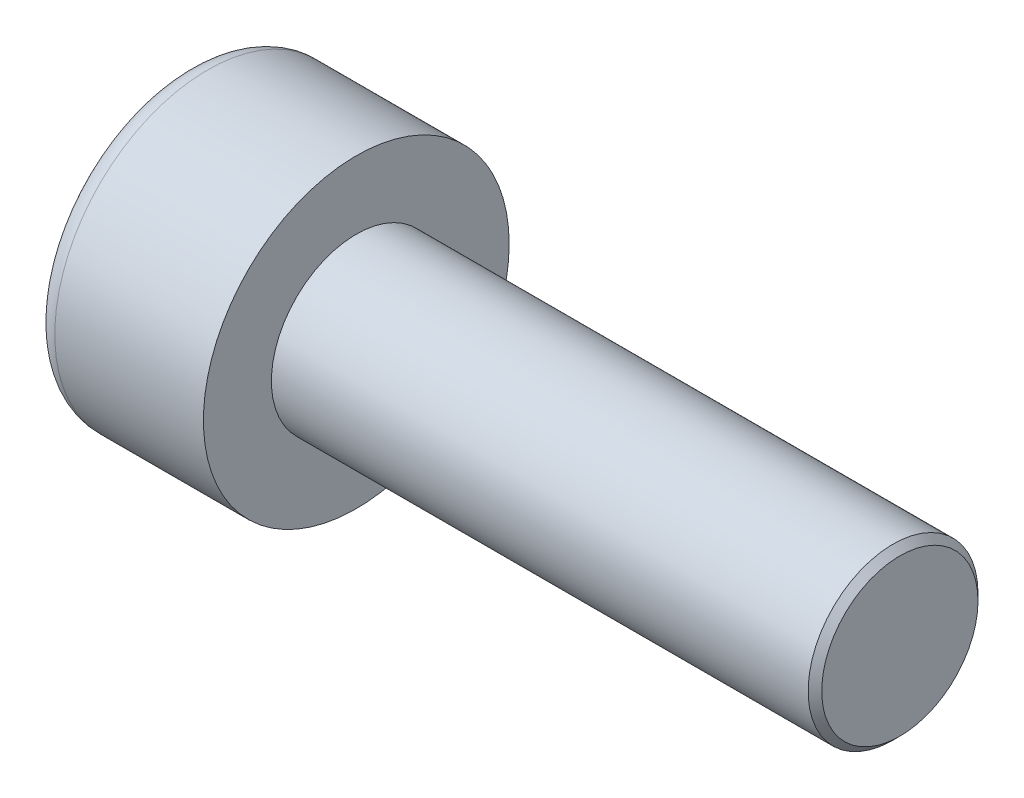
ISO-10303-21;
HEADER;
FILE_DESCRIPTION(('STEP AP214'),'2;1');
FILE_NAME('part.step','',(''),(''),'','','');
FILE_SCHEMA(('AUTOMOTIVE_DESIGN { 1 0 10303 214 1 1 1 1 }'));
ENDSEC;
DATA;
#1=APPLICATION_CONTEXT('core data for automotive mechanical design processes');
#2=APPLICATION_PROTOCOL_DEFINITION('international standard','automotive_design',2000,#1);
#3=PRODUCT_CONTEXT('',#1,'mechanical');
#4=PRODUCT('Part','Part','',(#3));
#5=PRODUCT_RELATED_PRODUCT_CATEGORY('part','',(#4));
#6=PRODUCT_DEFINITION_FORMATION('','',#4);
#7=PRODUCT_DEFINITION_CONTEXT('part definition',#1,'design');
#8=PRODUCT_DEFINITION('design','',#6,#7);
#9=PRODUCT_DEFINITION_SHAPE('','',#8);
#10=(LENGTH_UNIT() NAMED_UNIT(*) SI_UNIT(.MILLI.,.METRE.));
#11=(NAMED_UNIT(*) PLANE_ANGLE_UNIT() SI_UNIT($,.RADIAN.));
#12=(NAMED_UNIT(*) SI_UNIT($,.STERADIAN.) SOLID_ANGLE_UNIT());
#13=UNCERTAINTY_MEASURE_WITH_UNIT(LENGTH_MEASURE(1.E-05),#10,'distance_accuracy_value','');
#14=(GEOMETRIC_REPRESENTATION_CONTEXT(3) GLOBAL_UNCERTAINTY_ASSIGNED_CONTEXT((#13)) GLOBAL_UNIT_ASSIGNED_CONTEXT((#10,
#11,#12)) REPRESENTATION_CONTEXT('',''));
#15=CARTESIAN_POINT('',(0.,0.,0.));
#16=DIRECTION('',(0.,0.,1.));
#17=DIRECTION('',(1.,0.,0.));
#18=AXIS2_PLACEMENT_3D('',#15,#16,#17);
#19=CARTESIAN_POINT('',(1.1,1.,-1.73205080756888));
#20=DIRECTION('',(1.,0.,0.));
#21=DIRECTION('',(0.,0.,-1.));
#22=AXIS2_PLACEMENT_3D('',#19,#20,#21);
#23=PLANE('',#22);
#24=CARTESIAN_POINT('',(1.1,0.,0.));
#25=DIRECTION('',(1.,0.,0.));
#26=DIRECTION('',(0.,0.,-1.));
#27=AXIS2_PLACEMENT_3D('',#24,#25,#26);
#28=CIRCLE('',#27,1.);
#29=CARTESIAN_POINT('',(1.1,-0.5,-0.866025403784439));
#30=VERTEX_POINT('',#29);
#31=CARTESIAN_POINT('',(1.1,-1.,0.));
#32=VERTEX_POINT('',#31);
#33=EDGE_CURVE('E162',#30,#32,#28,.F.);
#34=ORIENTED_EDGE('',*,*,#33,.F.);
#35=DIRECTION('',(0.,0.866025403784439,-0.5));
#36=VECTOR('',#35,1.);
#37=CARTESIAN_POINT('',(1.1,-1.,-0.577350269189627));
#38=LINE('',#37,#36);
#39=CARTESIAN_POINT('',(1.1,-1.,-0.577350269189627));
#40=VERTEX_POINT('',#39);
#41=EDGE_CURVE('E170',#40,#30,#38,.T.);
#42=ORIENTED_EDGE('',*,*,#41,.F.);
#43=DIRECTION('',(0.,0.,-1.));
#44=VECTOR('',#43,1.);
#45=CARTESIAN_POINT('',(1.1,-1.,0.577350269189626));
#46=LINE('',#45,#44);
#47=EDGE_CURVE('E187',#32,#40,#46,.T.);
#48=ORIENTED_EDGE('',*,*,#47,.F.);
#49=EDGE_LOOP('',(#34,#42,#48));
#50=FACE_BOUND('',#49,.T.);
#51=ADVANCED_FACE('F39',(#50),#23,.F.);
#52=CARTESIAN_POINT('',(1.1,-0.5,0.866025403784438));
#53=VERTEX_POINT('',#52);
#54=EDGE_CURVE('E292',#32,#53,#28,.F.);
#55=ORIENTED_EDGE('',*,*,#54,.F.);
#56=CARTESIAN_POINT('',(1.1,-1.,0.577350269189626));
#57=VERTEX_POINT('',#56);
#58=EDGE_CURVE('E188',#57,#32,#46,.T.);
#59=ORIENTED_EDGE('',*,*,#58,.F.);
#60=DIRECTION('',(0.,-0.866025403784439,-0.5));
#61=VECTOR('',#60,1.);
#62=CARTESIAN_POINT('',(1.1,0.,1.15470053837925));
#63=LINE('',#62,#61);
#64=EDGE_CURVE('E183',#53,#57,#63,.T.);
#65=ORIENTED_EDGE('',*,*,#64,.F.);
#66=EDGE_LOOP('',(#55,#59,#65));
#67=FACE_BOUND('',#66,.T.);
#68=ADVANCED_FACE('F128',(#67),#23,.F.);
#69=CARTESIAN_POINT('',(1.1,0.5,0.866025403784438));
#70=VERTEX_POINT('',#69);
#71=EDGE_CURVE('E288',#53,#70,#28,.F.);
#72=ORIENTED_EDGE('',*,*,#71,.F.);
#73=CARTESIAN_POINT('',(1.1,0.,1.15470053837925));
#74=VERTEX_POINT('',#73);
#75=EDGE_CURVE('E184',#74,#53,#63,.T.);
#76=ORIENTED_EDGE('',*,*,#75,.F.);
#77=DIRECTION('',(0.,-0.866025403784439,0.5));
#78=VECTOR('',#77,1.);
#79=CARTESIAN_POINT('',(1.1,1.,0.577350269189626));
#80=LINE('',#79,#78);
#81=EDGE_CURVE('E179',#70,#74,#80,.T.);
#82=ORIENTED_EDGE('',*,*,#81,.F.);
#83=EDGE_LOOP('',(#72,#76,#82));
#84=FACE_BOUND('',#83,.T.);
#85=ADVANCED_FACE('F134',(#84),#23,.F.);
#86=CARTESIAN_POINT('',(1.1,1.,0.));
#87=VERTEX_POINT('',#86);
#88=EDGE_CURVE('E159',#70,#87,#28,.F.);
#89=ORIENTED_EDGE('',*,*,#88,.F.);
#90=CARTESIAN_POINT('',(1.1,1.,0.577350269189626));
#91=VERTEX_POINT('',#90);
#92=EDGE_CURVE('E180',#91,#70,#80,.T.);
#93=ORIENTED_EDGE('',*,*,#92,.F.);
#94=DIRECTION('',(0.,0.,1.));
#95=VECTOR('',#94,1.);
#96=CARTESIAN_POINT('',(1.1,1.,-0.577350269189625));
#97=LINE('',#96,#95);
#98=EDGE_CURVE('E174',#87,#91,#97,.T.);
#99=ORIENTED_EDGE('',*,*,#98,.F.);
#100=EDGE_LOOP('',(#89,#93,#99));
#101=FACE_BOUND('',#100,.T.);
#102=ADVANCED_FACE('F148',(#101),#23,.F.);
#103=CARTESIAN_POINT('',(1.1,0.,0.));
#104=DIRECTION('',(1.,0.,0.));
#105=DIRECTION('',(0.,0.,-1.));
#106=AXIS2_PLACEMENT_3D('',#103,#104,#105);
#107=CIRCLE('',#106,1.);
#108=CARTESIAN_POINT('',(1.1,0.5,-0.866025403784438));
#109=VERTEX_POINT('',#108);
#110=EDGE_CURVE('E54',#109,#87,#107,.T.);
#111=ORIENTED_EDGE('',*,*,#110,.T.);
#112=CARTESIAN_POINT('',(1.1,1.,-0.577350269189625));
#113=VERTEX_POINT('',#112);
#114=EDGE_CURVE('E167',#113,#87,#97,.T.);
#115=ORIENTED_EDGE('',*,*,#114,.F.);
#116=DIRECTION('',(0.,0.866025403784439,0.5));
#117=VECTOR('',#116,1.);
#118=CARTESIAN_POINT('',(1.1,0.,-1.15470053837925));
#119=LINE('',#118,#117);
#120=EDGE_CURVE('E164',#109,#113,#119,.T.);
#121=ORIENTED_EDGE('',*,*,#120,.F.);
#122=EDGE_LOOP('',(#111,#115,#121));
#123=FACE_BOUND('',#122,.T.);
#124=ADVANCED_FACE('F139',(#123),#23,.F.);
#125=EDGE_CURVE('E152',#109,#30,#28,.F.);
#126=ORIENTED_EDGE('',*,*,#125,.F.);
#127=CARTESIAN_POINT('',(1.1,0.,-1.15470053837925));
#128=VERTEX_POINT('',#127);
#129=EDGE_CURVE('E155',#128,#109,#119,.T.);
#130=ORIENTED_EDGE('',*,*,#129,.F.);
#131=EDGE_CURVE('E157',#30,#128,#38,.T.);
#132=ORIENTED_EDGE('',*,*,#131,.F.);
#133=EDGE_LOOP('',(#126,#130,#132));
#134=FACE_BOUND('',#133,.T.);
#135=ADVANCED_FACE('F130',(#134),#23,.F.);
#136=CARTESIAN_POINT('',(0.,0.,0.));
#137=DIRECTION('',(1.,0.,0.));
#138=DIRECTION('',(0.,0.,-1.));
#139=AXIS2_PLACEMENT_3D('',#136,#137,#138);
#140=PLANE('',#139);
#141=CARTESIAN_POINT('',(0.,0.,0.));
#142=DIRECTION('',(1.,0.,0.));
#143=DIRECTION('',(0.,0.,-1.));
#144=AXIS2_PLACEMENT_3D('',#141,#142,#143);
#145=CIRCLE('',#144,1.9375);
#146=CARTESIAN_POINT('',(0.,0.,-1.9375));
#147=VERTEX_POINT('',#146);
#148=EDGE_CURVE('E227',#147,#147,#145,.F.);
#149=ORIENTED_EDGE('',*,*,#148,.T.);
#150=EDGE_LOOP('',(#149));
#151=FACE_BOUND('',#150,.T.);
#152=DIRECTION('',(0.,0.866025403784439,-0.5));
#153=VECTOR('',#152,1.);
#154=CARTESIAN_POINT('',(0.,-1.,-0.577350269189627));
#155=LINE('',#154,#153);
#156=CARTESIAN_POINT('',(0.,-1.,-0.577350269189627));
#157=VERTEX_POINT('',#156);
#158=CARTESIAN_POINT('',(0.,0.,-1.15470053837925));
#159=VERTEX_POINT('',#158);
#160=EDGE_CURVE('E62',#157,#159,#155,.T.);
#161=ORIENTED_EDGE('',*,*,#160,.T.);
#162=DIRECTION('',(0.,0.866025403784439,0.5));
#163=VECTOR('',#162,1.);
#164=CARTESIAN_POINT('',(0.,0.,-1.15470053837925));
#165=LINE('',#164,#163);
#166=CARTESIAN_POINT('',(0.,1.,-0.577350269189625));
#167=VERTEX_POINT('',#166);
#168=EDGE_CURVE('E193',#159,#167,#165,.T.);
#169=ORIENTED_EDGE('',*,*,#168,.T.);
#170=DIRECTION('',(0.,0.,1.));
#171=VECTOR('',#170,1.);
#172=CARTESIAN_POINT('',(0.,1.,-0.577350269189625));
#173=LINE('',#172,#171);
#174=CARTESIAN_POINT('',(0.,1.,0.577350269189626));
#175=VERTEX_POINT('',#174);
#176=EDGE_CURVE('E196',#167,#175,#173,.T.);
#177=ORIENTED_EDGE('',*,*,#176,.T.);
#178=DIRECTION('',(0.,-0.866025403784439,0.5));
#179=VECTOR('',#178,1.);
#180=CARTESIAN_POINT('',(0.,1.,0.577350269189626));
#181=LINE('',#180,#179);
#182=CARTESIAN_POINT('',(0.,0.,1.15470053837925));
#183=VERTEX_POINT('',#182);
#184=EDGE_CURVE('E199',#175,#183,#181,.T.);
#185=ORIENTED_EDGE('',*,*,#184,.T.);
#186=DIRECTION('',(0.,-0.866025403784439,-0.5));
#187=VECTOR('',#186,1.);
#188=CARTESIAN_POINT('',(0.,0.,1.15470053837925));
#189=LINE('',#188,#187);
#190=CARTESIAN_POINT('',(0.,-1.,0.577350269189626));
#191=VERTEX_POINT('',#190);
#192=EDGE_CURVE('E202',#183,#191,#189,.T.);
#193=ORIENTED_EDGE('',*,*,#192,.T.);
#194=DIRECTION('',(0.,0.,-1.));
#195=VECTOR('',#194,1.);
#196=CARTESIAN_POINT('',(0.,-1.,0.577350269189626));
#197=LINE('',#196,#195);
#198=EDGE_CURVE('E205',#191,#157,#197,.T.);
#199=ORIENTED_EDGE('',*,*,#198,.T.);
#200=EDGE_LOOP('',(#161,#169,#177,#185,#193,#199));
#201=FACE_BOUND('',#200,.T.);
#202=ADVANCED_FACE('F138',(#151,#201),#140,.F.);
#203=CARTESIAN_POINT('',(2.5,0.,0.));
#204=DIRECTION('',(1.,0.,0.));
#205=DIRECTION('',(0.,0.,-1.));
#206=AXIS2_PLACEMENT_3D('',#203,#204,#205);
#207=PLANE('',#206);
#208=CARTESIAN_POINT('',(2.5,0.,0.));
#209=DIRECTION('',(1.,0.,0.));
#210=DIRECTION('',(0.,0.,-1.));
#211=AXIS2_PLACEMENT_3D('',#208,#209,#210);
#212=CIRCLE('',#211,2.25);
#213=CARTESIAN_POINT('',(2.5,0.,-2.25));
#214=VERTEX_POINT('',#213);
#215=EDGE_CURVE('E160',#214,#214,#212,.T.);
#216=ORIENTED_EDGE('',*,*,#215,.T.);
#217=EDGE_LOOP('',(#216));
#218=FACE_BOUND('',#217,.T.);
#219=CARTESIAN_POINT('',(2.5,0.,0.));
#220=DIRECTION('',(1.,0.,0.));
#221=DIRECTION('',(0.,0.,-1.));
#222=AXIS2_PLACEMENT_3D('',#219,#220,#221);
#223=CIRCLE('',#222,1.25);
#224=CARTESIAN_POINT('',(2.5,0.,-1.25));
#225=VERTEX_POINT('',#224);
#226=EDGE_CURVE('E218',#225,#225,#223,.T.);
#227=ORIENTED_EDGE('',*,*,#226,.F.);
#228=EDGE_LOOP('',(#227));
#229=FACE_BOUND('',#228,.T.);
#230=ADVANCED_FACE('F145',(#218,#229),#207,.T.);
#231=CARTESIAN_POINT('',(2.5,0.,0.));
#232=DIRECTION('',(-1.,0.,0.));
#233=DIRECTION('',(0.,0.,1.));
#234=AXIS2_PLACEMENT_3D('',#231,#232,#233);
#235=CYLINDRICAL_SURFACE('',#234,2.25);
#236=CARTESIAN_POINT('',(0.3125,0.,0.));
#237=DIRECTION('',(1.,0.,0.));
#238=DIRECTION('',(0.,0.,-1.));
#239=AXIS2_PLACEMENT_3D('',#236,#237,#238);
#240=CIRCLE('',#239,2.25);
#241=CARTESIAN_POINT('',(0.3125,0.,-2.25));
#242=VERTEX_POINT('',#241);
#243=EDGE_CURVE('E224',#242,#242,#240,.T.);
#244=ORIENTED_EDGE('',*,*,#243,.T.);
#245=EDGE_LOOP('',(#244));
#246=FACE_BOUND('',#245,.T.);
#247=ORIENTED_EDGE('',*,*,#215,.F.);
#248=EDGE_LOOP('',(#247));
#249=FACE_BOUND('',#248,.T.);
#250=ADVANCED_FACE('F243',(#246,#249),#235,.T.);
#251=CARTESIAN_POINT('',(10.5,0.,0.));
#252=DIRECTION('',(-1.,0.,0.));
#253=DIRECTION('',(0.,0.,1.));
#254=AXIS2_PLACEMENT_3D('',#251,#252,#253);
#255=CYLINDRICAL_SURFACE('',#254,1.25);
#256=CARTESIAN_POINT('',(10.4,0.,0.));
#257=DIRECTION('',(1.,0.,0.));
#258=DIRECTION('',(0.,0.,-1.));
#259=AXIS2_PLACEMENT_3D('',#256,#257,#258);
#260=CIRCLE('',#259,1.25);
#261=CARTESIAN_POINT('',(10.4,0.,-1.25));
#262=VERTEX_POINT('',#261);
#263=EDGE_CURVE('E11',#262,#262,#260,.F.);
#264=ORIENTED_EDGE('',*,*,#263,.T.);
#265=EDGE_LOOP('',(#264));
#266=FACE_BOUND('',#265,.T.);
#267=ORIENTED_EDGE('',*,*,#226,.T.);
#268=EDGE_LOOP('',(#267));
#269=FACE_BOUND('',#268,.T.);
#270=ADVANCED_FACE('F240',(#266,#269),#255,.T.);
#271=CARTESIAN_POINT('',(10.5,0.,0.));
#272=DIRECTION('',(1.,0.,0.));
#273=DIRECTION('',(0.,0.,-1.));
#274=AXIS2_PLACEMENT_3D('',#271,#272,#273);
#275=PLANE('',#274);
#276=CARTESIAN_POINT('',(10.5,0.,0.));
#277=DIRECTION('',(1.,0.,0.));
#278=DIRECTION('',(0.,0.,-1.));
#279=AXIS2_PLACEMENT_3D('',#276,#277,#278);
#280=CIRCLE('',#279,1.15);
#281=CARTESIAN_POINT('',(10.5,0.,-1.15));
#282=VERTEX_POINT('',#281);
#283=EDGE_CURVE('E47',#282,#282,#280,.T.);
#284=ORIENTED_EDGE('',*,*,#283,.T.);
#285=EDGE_LOOP('',(#284));
#286=FACE_BOUND('',#285,.T.);
#287=ADVANCED_FACE('F232',(#286),#275,.T.);
#288=CARTESIAN_POINT('',(1.1,-1.,-0.577350269189627));
#289=DIRECTION('',(0.,0.5,0.866025403784439));
#290=DIRECTION('',(0.,-0.866025403784439,0.5));
#291=AXIS2_PLACEMENT_3D('',#288,#289,#290);
#292=PLANE('',#291);
#293=ORIENTED_EDGE('',*,*,#160,.F.);
#294=DIRECTION('',(-1.,0.,0.));
#295=VECTOR('',#294,1.);
#296=CARTESIAN_POINT('',(1.1,-1.,-0.577350269189627));
#297=LINE('',#296,#295);
#298=EDGE_CURVE('E191',#40,#157,#297,.T.);
#299=ORIENTED_EDGE('',*,*,#298,.F.);
#300=ORIENTED_EDGE('',*,*,#41,.T.);
#301=ORIENTED_EDGE('',*,*,#131,.T.);
#302=DIRECTION('',(-1.,0.,0.));
#303=VECTOR('',#302,1.);
#304=CARTESIAN_POINT('',(1.1,0.,-1.15470053837925));
#305=LINE('',#304,#303);
#306=EDGE_CURVE('E173',#128,#159,#305,.T.);
#307=ORIENTED_EDGE('',*,*,#306,.T.);
#308=EDGE_LOOP('',(#293,#299,#300,#301,#307));
#309=FACE_BOUND('',#308,.T.);
#310=ADVANCED_FACE('F258',(#309),#292,.T.);
#311=CARTESIAN_POINT('',(1.1,0.,-1.15470053837925));
#312=DIRECTION('',(0.,-0.5,0.866025403784439));
#313=DIRECTION('',(0.,-0.866025403784439,-0.5));
#314=AXIS2_PLACEMENT_3D('',#311,#312,#313);
#315=PLANE('',#314);
#316=ORIENTED_EDGE('',*,*,#168,.F.);
#317=ORIENTED_EDGE('',*,*,#306,.F.);
#318=ORIENTED_EDGE('',*,*,#129,.T.);
#319=ORIENTED_EDGE('',*,*,#120,.T.);
#320=DIRECTION('',(-1.,0.,0.));
#321=VECTOR('',#320,1.);
#322=CARTESIAN_POINT('',(1.1,1.,-0.577350269189625));
#323=LINE('',#322,#321);
#324=EDGE_CURVE('E215',#113,#167,#323,.T.);
#325=ORIENTED_EDGE('',*,*,#324,.T.);
#326=EDGE_LOOP('',(#316,#317,#318,#319,#325));
#327=FACE_BOUND('',#326,.T.);
#328=ADVANCED_FACE('F172',(#327),#315,.T.);
#329=CARTESIAN_POINT('',(1.1,1.,-0.577350269189625));
#330=DIRECTION('',(0.,-1.,0.));
#331=DIRECTION('',(0.,0.,-1.));
#332=AXIS2_PLACEMENT_3D('',#329,#330,#331);
#333=PLANE('',#332);
#334=ORIENTED_EDGE('',*,*,#176,.F.);
#335=ORIENTED_EDGE('',*,*,#324,.F.);
#336=ORIENTED_EDGE('',*,*,#114,.T.);
#337=ORIENTED_EDGE('',*,*,#98,.T.);
#338=DIRECTION('',(-1.,0.,0.));
#339=VECTOR('',#338,1.);
#340=CARTESIAN_POINT('',(1.1,1.,0.577350269189626));
#341=LINE('',#340,#339);
#342=EDGE_CURVE('E213',#91,#175,#341,.T.);
#343=ORIENTED_EDGE('',*,*,#342,.T.);
#344=EDGE_LOOP('',(#334,#335,#336,#337,#343));
#345=FACE_BOUND('',#344,.T.);
#346=ADVANCED_FACE('F263',(#345),#333,.T.);
#347=CARTESIAN_POINT('',(1.1,1.,0.577350269189626));
#348=DIRECTION('',(0.,-0.5,-0.866025403784439));
#349=DIRECTION('',(0.,0.866025403784439,-0.5));
#350=AXIS2_PLACEMENT_3D('',#347,#348,#349);
#351=PLANE('',#350);
#352=ORIENTED_EDGE('',*,*,#184,.F.);
#353=ORIENTED_EDGE('',*,*,#342,.F.);
#354=ORIENTED_EDGE('',*,*,#92,.T.);
#355=ORIENTED_EDGE('',*,*,#81,.T.);
#356=DIRECTION('',(-1.,0.,0.));
#357=VECTOR('',#356,1.);
#358=CARTESIAN_POINT('',(1.1,0.,1.15470053837925));
#359=LINE('',#358,#357);
#360=EDGE_CURVE('E211',#74,#183,#359,.T.);
#361=ORIENTED_EDGE('',*,*,#360,.T.);
#362=EDGE_LOOP('',(#352,#353,#354,#355,#361));
#363=FACE_BOUND('',#362,.T.);
#364=ADVANCED_FACE('F266',(#363),#351,.T.);
#365=CARTESIAN_POINT('',(1.1,0.,1.15470053837925));
#366=DIRECTION('',(0.,0.5,-0.866025403784438));
#367=DIRECTION('',(0.,0.866025403784439,0.5));
#368=AXIS2_PLACEMENT_3D('',#365,#366,#367);
#369=PLANE('',#368);
#370=ORIENTED_EDGE('',*,*,#192,.F.);
#371=ORIENTED_EDGE('',*,*,#360,.F.);
#372=ORIENTED_EDGE('',*,*,#75,.T.);
#373=ORIENTED_EDGE('',*,*,#64,.T.);
#374=DIRECTION('',(-1.,0.,0.));
#375=VECTOR('',#374,1.);
#376=CARTESIAN_POINT('',(1.1,-1.,0.577350269189626));
#377=LINE('',#376,#375);
#378=EDGE_CURVE('E209',#57,#191,#377,.T.);
#379=ORIENTED_EDGE('',*,*,#378,.T.);
#380=EDGE_LOOP('',(#370,#371,#372,#373,#379));
#381=FACE_BOUND('',#380,.T.);
#382=ADVANCED_FACE('F123',(#381),#369,.T.);
#383=CARTESIAN_POINT('',(1.1,-1.,0.577350269189626));
#384=DIRECTION('',(0.,1.,0.));
#385=DIRECTION('',(0.,0.,1.));
#386=AXIS2_PLACEMENT_3D('',#383,#384,#385);
#387=PLANE('',#386);
#388=ORIENTED_EDGE('',*,*,#198,.F.);
#389=ORIENTED_EDGE('',*,*,#378,.F.);
#390=ORIENTED_EDGE('',*,*,#58,.T.);
#391=ORIENTED_EDGE('',*,*,#47,.T.);
#392=ORIENTED_EDGE('',*,*,#298,.T.);
#393=EDGE_LOOP('',(#388,#389,#390,#391,#392));
#394=FACE_BOUND('',#393,.T.);
#395=ADVANCED_FACE('F116',(#394),#387,.T.);
#396=CARTESIAN_POINT('',(1.1,0.,0.));
#397=DIRECTION('',(-1.,0.,0.));
#398=DIRECTION('',(0.,0.,1.));
#399=AXIS2_PLACEMENT_3D('',#396,#397,#398);
#400=CONICAL_SURFACE('',#399,1.,1.04719755119659);
#401=CARTESIAN_POINT('',(1.67735026918963,0.,0.));
#402=VERTEX_POINT('',#401);
#403=VERTEX_LOOP('',#402);
#404=FACE_BOUND('',#403,.T.);
#405=ORIENTED_EDGE('',*,*,#110,.F.);
#406=ORIENTED_EDGE('',*,*,#125,.T.);
#407=ORIENTED_EDGE('',*,*,#33,.T.);
#408=ORIENTED_EDGE('',*,*,#54,.T.);
#409=ORIENTED_EDGE('',*,*,#71,.T.);
#410=ORIENTED_EDGE('',*,*,#88,.T.);
#411=EDGE_LOOP('',(#405,#406,#407,#408,#409,#410));
#412=FACE_BOUND('',#411,.T.);
#413=ADVANCED_FACE('F113',(#404,#412),#400,.F.);
#414=CARTESIAN_POINT('',(0.3125,0.,0.));
#415=DIRECTION('',(1.,0.,0.));
#416=DIRECTION('',(0.,0.,-1.));
#417=AXIS2_PLACEMENT_3D('',#414,#415,#416);
#418=TOROIDAL_SURFACE('',#417,1.9375,0.3125);
#419=ORIENTED_EDGE('',*,*,#148,.F.);
#420=EDGE_LOOP('',(#419));
#421=FACE_BOUND('',#420,.T.);
#422=ORIENTED_EDGE('',*,*,#243,.F.);
#423=EDGE_LOOP('',(#422));
#424=FACE_BOUND('',#423,.T.);
#425=ADVANCED_FACE('F115',(#421,#424),#418,.T.);
#426=CARTESIAN_POINT('',(10.5,0.,0.));
#427=DIRECTION('',(-1.,0.,0.));
#428=DIRECTION('',(0.,0.,1.));
#429=AXIS2_PLACEMENT_3D('',#426,#427,#428);
#430=CONICAL_SURFACE('',#429,1.15,0.785398163397451);
#431=ORIENTED_EDGE('',*,*,#263,.F.);
#432=EDGE_LOOP('',(#431));
#433=FACE_BOUND('',#432,.T.);
#434=ORIENTED_EDGE('',*,*,#283,.F.);
#435=EDGE_LOOP('',(#434));
#436=FACE_BOUND('',#435,.T.);
#437=ADVANCED_FACE('F41',(#433,#436),#430,.T.);
#438=CLOSED_SHELL('',(#51,#68,#85,#102,#124,#135,#202,#230,#250,#270,#287,#310,#328,#346,#364,
#382,#395,#413,#425,#437));
#439=MANIFOLD_SOLID_BREP('B2',#438);
#440=ADVANCED_BREP_SHAPE_REPRESENTATION('',(#18,#439),#14);
#441=SHAPE_DEFINITION_REPRESENTATION(#9,#440);
ENDSEC;
END-ISO-10303-21;
